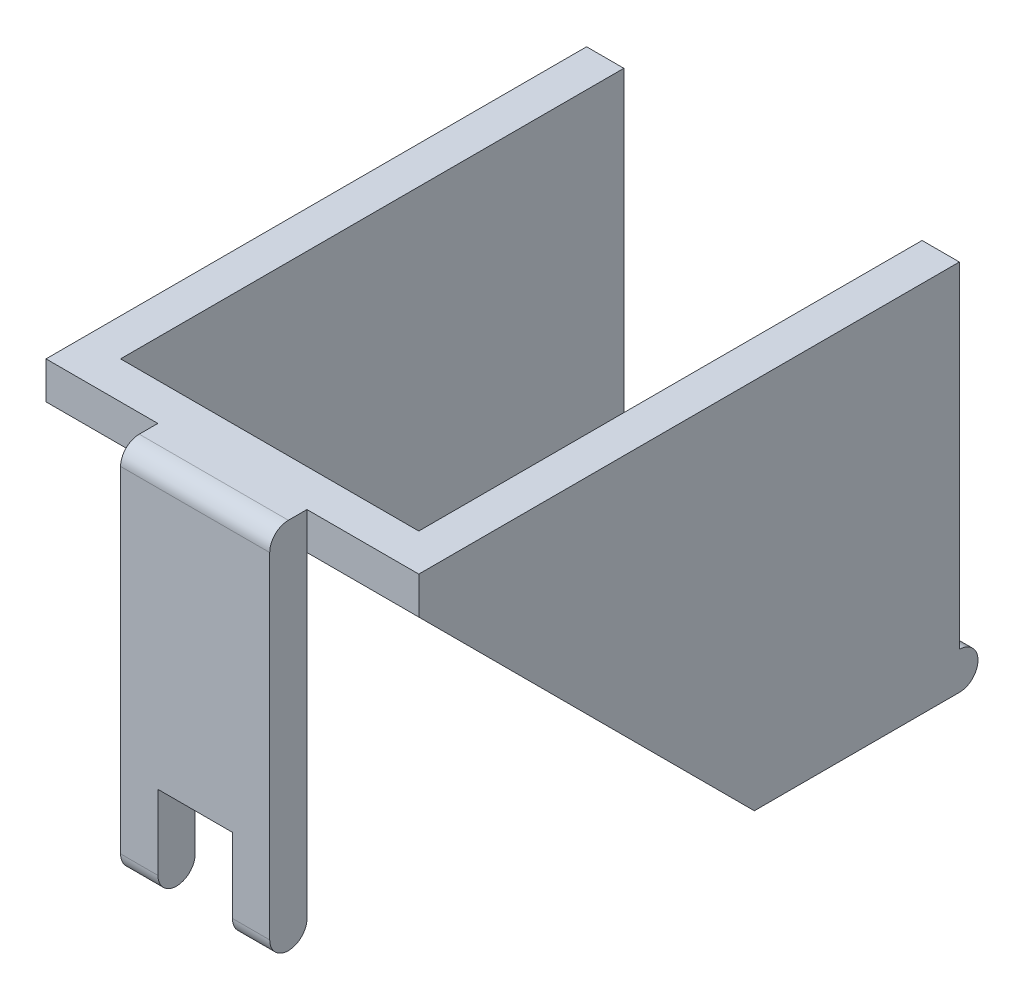
ISO-10303-21;
HEADER;
FILE_DESCRIPTION(('STEP AP214'),'2;1');
FILE_NAME('part.step','',(''),(''),'','','');
FILE_SCHEMA(('AUTOMOTIVE_DESIGN { 1 0 10303 214 1 1 1 1 }'));
ENDSEC;
DATA;
#1=APPLICATION_CONTEXT('core data for automotive mechanical design processes');
#2=APPLICATION_PROTOCOL_DEFINITION('international standard','automotive_design',2000,#1);
#3=PRODUCT_CONTEXT('',#1,'mechanical');
#4=PRODUCT('Part','Part','',(#3));
#5=PRODUCT_RELATED_PRODUCT_CATEGORY('part','',(#4));
#6=PRODUCT_DEFINITION_FORMATION('','',#4);
#7=PRODUCT_DEFINITION_CONTEXT('part definition',#1,'design');
#8=PRODUCT_DEFINITION('design','',#6,#7);
#9=PRODUCT_DEFINITION_SHAPE('','',#8);
#10=(LENGTH_UNIT() NAMED_UNIT(*) SI_UNIT(.MILLI.,.METRE.));
#11=(NAMED_UNIT(*) PLANE_ANGLE_UNIT() SI_UNIT($,.RADIAN.));
#12=(NAMED_UNIT(*) SI_UNIT($,.STERADIAN.) SOLID_ANGLE_UNIT());
#13=UNCERTAINTY_MEASURE_WITH_UNIT(LENGTH_MEASURE(1.E-05),#10,'distance_accuracy_value','');
#14=(GEOMETRIC_REPRESENTATION_CONTEXT(3) GLOBAL_UNCERTAINTY_ASSIGNED_CONTEXT((#13)) GLOBAL_UNIT_ASSIGNED_CONTEXT((#10,
#11,#12)) REPRESENTATION_CONTEXT('',''));
#15=CARTESIAN_POINT('',(0.,0.,0.));
#16=DIRECTION('',(0.,0.,1.));
#17=DIRECTION('',(1.,0.,0.));
#18=AXIS2_PLACEMENT_3D('',#15,#16,#17);
#19=CARTESIAN_POINT('',(0.,-9.,-15.));
#20=DIRECTION('',(1.,0.,0.));
#21=DIRECTION('',(0.,0.,-1.));
#22=AXIS2_PLACEMENT_3D('',#19,#20,#21);
#23=CYLINDRICAL_SURFACE('',#22,1.);
#24=CARTESIAN_POINT('',(6.,-9.,-15.));
#25=DIRECTION('',(-1.,0.,0.));
#26=DIRECTION('',(0.,0.,1.));
#27=AXIS2_PLACEMENT_3D('',#24,#25,#26);
#28=CIRCLE('',#27,1.);
#29=CARTESIAN_POINT('',(6.,-10.,-15.));
#30=VERTEX_POINT('',#29);
#31=CARTESIAN_POINT('',(6.,-8.,-15.));
#32=VERTEX_POINT('',#31);
#33=EDGE_CURVE('E238',#30,#32,#28,.F.);
#34=ORIENTED_EDGE('',*,*,#33,.F.);
#35=DIRECTION('',(-1.,0.,0.));
#36=VECTOR('',#35,1.);
#37=CARTESIAN_POINT('',(20.,-10.,-15.));
#38=LINE('',#37,#36);
#39=CARTESIAN_POINT('',(0.,-10.,-15.));
#40=VERTEX_POINT('',#39);
#41=EDGE_CURVE('E391',#30,#40,#38,.T.);
#42=ORIENTED_EDGE('',*,*,#41,.T.);
#43=CARTESIAN_POINT('',(0.,-9.,-15.));
#44=DIRECTION('',(1.,0.,0.));
#45=DIRECTION('',(0.,0.,-1.));
#46=AXIS2_PLACEMENT_3D('',#43,#44,#45);
#47=CIRCLE('',#46,1.);
#48=CARTESIAN_POINT('',(0.,-8.,-15.));
#49=VERTEX_POINT('',#48);
#50=EDGE_CURVE('E295',#40,#49,#47,.T.);
#51=ORIENTED_EDGE('',*,*,#50,.T.);
#52=DIRECTION('',(1.,0.,0.));
#53=VECTOR('',#52,1.);
#54=CARTESIAN_POINT('',(0.,-8.,-15.));
#55=LINE('',#54,#53);
#56=CARTESIAN_POINT('',(2.,-8.,-15.));
#57=VERTEX_POINT('',#56);
#58=EDGE_CURVE('E298',#57,#49,#55,.F.);
#59=ORIENTED_EDGE('',*,*,#58,.F.);
#60=EDGE_CURVE('E304',#32,#57,#55,.F.);
#61=ORIENTED_EDGE('',*,*,#60,.F.);
#62=EDGE_LOOP('',(#34,#42,#51,#59,#61));
#63=FACE_BOUND('',#62,.T.);
#64=ADVANCED_FACE('F38',(#63),#23,.T.);
#65=CARTESIAN_POINT('',(6.,-9.00000000000001,15.0000000000001));
#66=DIRECTION('',(1.,0.,0.));
#67=DIRECTION('',(0.,0.,-1.));
#68=AXIS2_PLACEMENT_3D('',#65,#66,#67);
#69=CYLINDRICAL_SURFACE('',#68,0.999999999999998);
#70=CARTESIAN_POINT('',(8.,-9.00000000000001,15.0000000000001));
#71=DIRECTION('',(-1.,0.,0.));
#72=DIRECTION('',(0.,-1.,0.));
#73=AXIS2_PLACEMENT_3D('',#70,#71,#72);
#74=CIRCLE('',#73,0.999999999999998);
#75=CARTESIAN_POINT('',(8.,-9.00000000000001,16.));
#76=VERTEX_POINT('',#75);
#77=CARTESIAN_POINT('',(8.,-9.00000000000001,14.0000000000001));
#78=VERTEX_POINT('',#77);
#79=EDGE_CURVE('E257',#76,#78,#74,.F.);
#80=ORIENTED_EDGE('',*,*,#79,.F.);
#81=DIRECTION('',(1.,0.,0.));
#82=VECTOR('',#81,1.);
#83=CARTESIAN_POINT('',(6.,-9.00000000000001,16.0000000000001));
#84=LINE('',#83,#82);
#85=CARTESIAN_POINT('',(6.,-9.00000000000001,16.0000000000001));
#86=VERTEX_POINT('',#85);
#87=EDGE_CURVE('E327',#86,#76,#84,.T.);
#88=ORIENTED_EDGE('',*,*,#87,.F.);
#89=CARTESIAN_POINT('',(6.,-9.00000000000001,15.0000000000001));
#90=DIRECTION('',(1.,0.,0.));
#91=DIRECTION('',(0.,0.,-1.));
#92=AXIS2_PLACEMENT_3D('',#89,#90,#91);
#93=CIRCLE('',#92,0.999999999999998);
#94=CARTESIAN_POINT('',(6.,-9.00000000000001,14.0000000000001));
#95=VERTEX_POINT('',#94);
#96=EDGE_CURVE('E308',#86,#95,#93,.T.);
#97=ORIENTED_EDGE('',*,*,#96,.T.);
#98=DIRECTION('',(1.,0.,0.));
#99=VECTOR('',#98,1.);
#100=CARTESIAN_POINT('',(6.,-9.00000000000001,14.0000000000001));
#101=LINE('',#100,#99);
#102=EDGE_CURVE('E322',#95,#78,#101,.T.);
#103=ORIENTED_EDGE('',*,*,#102,.T.);
#104=EDGE_LOOP('',(#80,#88,#97,#103));
#105=FACE_BOUND('',#104,.T.);
#106=ADVANCED_FACE('F446',(#105),#69,.T.);
#107=CARTESIAN_POINT('',(20.,10.,-15.));
#108=DIRECTION('',(0.,0.,1.));
#109=DIRECTION('',(0.,-1.,0.));
#110=AXIS2_PLACEMENT_3D('',#107,#108,#109);
#111=PLANE('',#110);
#112=DIRECTION('',(-1.,0.,0.));
#113=VECTOR('',#112,1.);
#114=CARTESIAN_POINT('',(20.,10.,-15.));
#115=LINE('',#114,#113);
#116=CARTESIAN_POINT('',(2.,10.,-15.));
#117=VERTEX_POINT('',#116);
#118=CARTESIAN_POINT('',(0.,10.,-15.));
#119=VERTEX_POINT('',#118);
#120=EDGE_CURVE('E387',#117,#119,#115,.T.);
#121=ORIENTED_EDGE('',*,*,#120,.F.);
#122=DIRECTION('',(0.,-1.,0.));
#123=VECTOR('',#122,1.);
#124=CARTESIAN_POINT('',(2.,10.,-15.));
#125=LINE('',#124,#123);
#126=EDGE_CURVE('E285',#117,#57,#125,.T.);
#127=ORIENTED_EDGE('',*,*,#126,.T.);
#128=ORIENTED_EDGE('',*,*,#58,.T.);
#129=DIRECTION('',(0.,1.,0.));
#130=VECTOR('',#129,1.);
#131=CARTESIAN_POINT('',(0.,10.,-15.));
#132=LINE('',#131,#130);
#133=EDGE_CURVE('E380',#49,#119,#132,.T.);
#134=ORIENTED_EDGE('',*,*,#133,.T.);
#135=EDGE_LOOP('',(#121,#127,#128,#134));
#136=FACE_BOUND('',#135,.T.);
#137=ADVANCED_FACE('F466',(#136),#111,.F.);
#138=CARTESIAN_POINT('',(20.,9.,15.));
#139=DIRECTION('',(-1.,0.,0.));
#140=DIRECTION('',(0.,0.,1.));
#141=AXIS2_PLACEMENT_3D('',#138,#139,#140);
#142=CYLINDRICAL_SURFACE('',#141,1.);
#143=DIRECTION('',(1.,0.,0.));
#144=VECTOR('',#143,1.);
#145=CARTESIAN_POINT('',(6.,9.,16.));
#146=LINE('',#145,#144);
#147=CARTESIAN_POINT('',(6.,9.,16.));
#148=VERTEX_POINT('',#147);
#149=CARTESIAN_POINT('',(14.,9.,16.));
#150=VERTEX_POINT('',#149);
#151=EDGE_CURVE('E315',#148,#150,#146,.T.);
#152=ORIENTED_EDGE('',*,*,#151,.T.);
#153=CARTESIAN_POINT('',(14.,9.,15.));
#154=DIRECTION('',(-1.,0.,0.));
#155=DIRECTION('',(0.,0.,1.));
#156=AXIS2_PLACEMENT_3D('',#153,#154,#155);
#157=CIRCLE('',#156,1.);
#158=CARTESIAN_POINT('',(14.,10.,15.));
#159=VERTEX_POINT('',#158);
#160=EDGE_CURVE('E358',#150,#159,#157,.T.);
#161=ORIENTED_EDGE('',*,*,#160,.T.);
#162=DIRECTION('',(-1.,0.,0.));
#163=VECTOR('',#162,1.);
#164=CARTESIAN_POINT('',(20.,10.,15.));
#165=LINE('',#164,#163);
#166=CARTESIAN_POINT('',(6.,10.,15.));
#167=VERTEX_POINT('',#166);
#168=EDGE_CURVE('E375',#159,#167,#165,.T.);
#169=ORIENTED_EDGE('',*,*,#168,.T.);
#170=CARTESIAN_POINT('',(6.,9.,15.));
#171=DIRECTION('',(1.,0.,0.));
#172=DIRECTION('',(0.,0.,-1.));
#173=AXIS2_PLACEMENT_3D('',#170,#171,#172);
#174=CIRCLE('',#173,1.);
#175=EDGE_CURVE('E360',#167,#148,#174,.T.);
#176=ORIENTED_EDGE('',*,*,#175,.T.);
#177=EDGE_LOOP('',(#152,#161,#169,#176));
#178=FACE_BOUND('',#177,.T.);
#179=ADVANCED_FACE('F40',(#178),#142,.T.);
#180=CARTESIAN_POINT('',(20.,8.29289321881345,14.2928932188134));
#181=DIRECTION('',(0.,0.707106781186547,-0.707106781186548));
#182=DIRECTION('',(0.,0.707106781186548,0.707106781186547));
#183=AXIS2_PLACEMENT_3D('',#180,#181,#182);
#184=PLANE('',#183);
#185=DIRECTION('',(0.,0.707106781186548,0.707106781186547));
#186=VECTOR('',#185,1.);
#187=CARTESIAN_POINT('',(2.,8.29289321881345,14.2928932188134));
#188=LINE('',#187,#186);
#189=CARTESIAN_POINT('',(2.,-8.,-2.));
#190=VERTEX_POINT('',#189);
#191=CARTESIAN_POINT('',(2.,6.00257999370378,12.0025799937038));
#192=VERTEX_POINT('',#191);
#193=EDGE_CURVE('E288',#190,#192,#188,.T.);
#194=ORIENTED_EDGE('',*,*,#193,.T.);
#195=DIRECTION('',(1.,0.,0.));
#196=VECTOR('',#195,1.);
#197=CARTESIAN_POINT('',(20.,6.00257999370378,12.0025799937038));
#198=LINE('',#197,#196);
#199=CARTESIAN_POINT('',(18.,6.00257999370378,12.0025799937038));
#200=VERTEX_POINT('',#199);
#201=EDGE_CURVE('E291',#192,#200,#198,.T.);
#202=ORIENTED_EDGE('',*,*,#201,.T.);
#203=DIRECTION('',(0.,-0.707106781186548,-0.707106781186547));
#204=VECTOR('',#203,1.);
#205=CARTESIAN_POINT('',(18.,8.29289321881345,14.2928932188134));
#206=LINE('',#205,#204);
#207=CARTESIAN_POINT('',(18.,-8.,-2.));
#208=VERTEX_POINT('',#207);
#209=EDGE_CURVE('E282',#200,#208,#206,.T.);
#210=ORIENTED_EDGE('',*,*,#209,.T.);
#211=DIRECTION('',(1.,0.,0.));
#212=VECTOR('',#211,1.);
#213=CARTESIAN_POINT('',(20.,-8.,-2.));
#214=LINE('',#213,#212);
#215=EDGE_CURVE('E276',#190,#208,#214,.T.);
#216=ORIENTED_EDGE('',*,*,#215,.F.);
#217=EDGE_LOOP('',(#194,#202,#210,#216));
#218=FACE_BOUND('',#217,.T.);
#219=DIRECTION('',(0.,-0.707106781186548,-0.707106781186547));
#220=VECTOR('',#219,1.);
#221=CARTESIAN_POINT('',(6.,8.29289321881345,14.2928932188134));
#222=LINE('',#221,#220);
#223=CARTESIAN_POINT('',(6.,8.00257999370377,14.0025799937038));
#224=VERTEX_POINT('',#223);
#225=CARTESIAN_POINT('',(6.,8.,14.));
#226=VERTEX_POINT('',#225);
#227=EDGE_CURVE('E335',#224,#226,#222,.T.);
#228=ORIENTED_EDGE('',*,*,#227,.F.);
#229=DIRECTION('',(-1.,0.,0.));
#230=VECTOR('',#229,1.);
#231=CARTESIAN_POINT('',(20.,8.00257999370378,14.0025799937038));
#232=LINE('',#231,#230);
#233=CARTESIAN_POINT('',(0.,8.00257999370378,14.0025799937038));
#234=VERTEX_POINT('',#233);
#235=EDGE_CURVE('E346',#224,#234,#232,.T.);
#236=ORIENTED_EDGE('',*,*,#235,.T.);
#237=DIRECTION('',(0.,-0.707106781186548,-0.707106781186547));
#238=VECTOR('',#237,1.);
#239=CARTESIAN_POINT('',(0.,8.29289321881345,14.2928932188134));
#240=LINE('',#239,#238);
#241=CARTESIAN_POINT('',(0.,-10.,-4.00000000000001));
#242=VERTEX_POINT('',#241);
#243=EDGE_CURVE('E363',#234,#242,#240,.T.);
#244=ORIENTED_EDGE('',*,*,#243,.T.);
#245=DIRECTION('',(-1.,0.,0.));
#246=VECTOR('',#245,1.);
#247=CARTESIAN_POINT('',(20.,-10.,-4.00000000000001));
#248=LINE('',#247,#246);
#249=CARTESIAN_POINT('',(20.,-10.,-4.00000000000001));
#250=VERTEX_POINT('',#249);
#251=EDGE_CURVE('E395',#250,#242,#248,.T.);
#252=ORIENTED_EDGE('',*,*,#251,.F.);
#253=DIRECTION('',(0.,-0.707106781186548,-0.707106781186547));
#254=VECTOR('',#253,1.);
#255=CARTESIAN_POINT('',(20.,8.29289321881345,14.2928932188134));
#256=LINE('',#255,#254);
#257=CARTESIAN_POINT('',(20.,8.00257999370378,14.0025799937038));
#258=VERTEX_POINT('',#257);
#259=EDGE_CURVE('E364',#258,#250,#256,.T.);
#260=ORIENTED_EDGE('',*,*,#259,.F.);
#261=DIRECTION('',(-1.,0.,0.));
#262=VECTOR('',#261,1.);
#263=CARTESIAN_POINT('',(20.,8.00257999370378,14.0025799937038));
#264=LINE('',#263,#262);
#265=CARTESIAN_POINT('',(14.,8.00257999370377,14.0025799937038));
#266=VERTEX_POINT('',#265);
#267=EDGE_CURVE('E355',#258,#266,#264,.T.);
#268=ORIENTED_EDGE('',*,*,#267,.T.);
#269=DIRECTION('',(0.,-0.707106781186548,-0.707106781186547));
#270=VECTOR('',#269,1.);
#271=CARTESIAN_POINT('',(14.,8.29289321881345,14.2928932188134));
#272=LINE('',#271,#270);
#273=CARTESIAN_POINT('',(14.,7.99999999999999,14.));
#274=VERTEX_POINT('',#273);
#275=EDGE_CURVE('E325',#266,#274,#272,.T.);
#276=ORIENTED_EDGE('',*,*,#275,.T.);
#277=DIRECTION('',(-1.,0.,0.));
#278=VECTOR('',#277,1.);
#279=CARTESIAN_POINT('',(20.,8.,14.));
#280=LINE('',#279,#278);
#281=EDGE_CURVE('E403',#274,#226,#280,.T.);
#282=ORIENTED_EDGE('',*,*,#281,.T.);
#283=EDGE_LOOP('',(#228,#236,#244,#252,#260,#268,#276,#282));
#284=FACE_BOUND('',#283,.T.);
#285=ADVANCED_FACE('F513',(#218,#284),#184,.F.);
#286=CARTESIAN_POINT('',(20.,-10.,-4.00000000000001));
#287=DIRECTION('',(0.,1.,0.));
#288=DIRECTION('',(0.,0.,1.));
#289=AXIS2_PLACEMENT_3D('',#286,#287,#288);
#290=PLANE('',#289);
#291=ORIENTED_EDGE('',*,*,#41,.F.);
#292=DIRECTION('',(0.,0.,1.));
#293=VECTOR('',#292,1.);
#294=CARTESIAN_POINT('',(6.,-10.,-4.00000000000001));
#295=LINE('',#294,#293);
#296=CARTESIAN_POINT('',(6.,-10.,-12.));
#297=VERTEX_POINT('',#296);
#298=EDGE_CURVE('E240',#30,#297,#295,.T.);
#299=ORIENTED_EDGE('',*,*,#298,.T.);
#300=DIRECTION('',(1.,0.,0.));
#301=VECTOR('',#300,1.);
#302=CARTESIAN_POINT('',(20.,-10.,-12.));
#303=LINE('',#302,#301);
#304=CARTESIAN_POINT('',(14.,-10.,-12.));
#305=VERTEX_POINT('',#304);
#306=EDGE_CURVE('E219',#297,#305,#303,.T.);
#307=ORIENTED_EDGE('',*,*,#306,.T.);
#308=DIRECTION('',(0.,0.,-1.));
#309=VECTOR('',#308,1.);
#310=CARTESIAN_POINT('',(14.,-10.,-4.00000000000001));
#311=LINE('',#310,#309);
#312=CARTESIAN_POINT('',(14.,-10.,-15.));
#313=VERTEX_POINT('',#312);
#314=EDGE_CURVE('E217',#305,#313,#311,.T.);
#315=ORIENTED_EDGE('',*,*,#314,.T.);
#316=CARTESIAN_POINT('',(20.,-10.,-15.));
#317=VERTEX_POINT('',#316);
#318=EDGE_CURVE('E392',#317,#313,#38,.T.);
#319=ORIENTED_EDGE('',*,*,#318,.F.);
#320=DIRECTION('',(0.,0.,-1.));
#321=VECTOR('',#320,1.);
#322=CARTESIAN_POINT('',(20.,-10.,-4.00000000000001));
#323=LINE('',#322,#321);
#324=EDGE_CURVE('E366',#250,#317,#323,.T.);
#325=ORIENTED_EDGE('',*,*,#324,.F.);
#326=ORIENTED_EDGE('',*,*,#251,.T.);
#327=DIRECTION('',(0.,0.,-1.));
#328=VECTOR('',#327,1.);
#329=CARTESIAN_POINT('',(0.,-10.,-4.00000000000001));
#330=LINE('',#329,#328);
#331=EDGE_CURVE('E377',#242,#40,#330,.T.);
#332=ORIENTED_EDGE('',*,*,#331,.T.);
#333=EDGE_LOOP('',(#291,#299,#307,#315,#319,#325,#326,#332));
#334=FACE_BOUND('',#333,.T.);
#335=ADVANCED_FACE('F486',(#334),#290,.F.);
#336=CARTESIAN_POINT('',(20.,-8.,-15.));
#337=VERTEX_POINT('',#336);
#338=CARTESIAN_POINT('',(18.,-8.,-15.));
#339=VERTEX_POINT('',#338);
#340=EDGE_CURVE('E300',#337,#339,#55,.F.);
#341=ORIENTED_EDGE('',*,*,#340,.T.);
#342=DIRECTION('',(0.,1.,0.));
#343=VECTOR('',#342,1.);
#344=CARTESIAN_POINT('',(18.,10.,-15.));
#345=LINE('',#344,#343);
#346=CARTESIAN_POINT('',(18.,10.,-15.));
#347=VERTEX_POINT('',#346);
#348=EDGE_CURVE('E279',#339,#347,#345,.T.);
#349=ORIENTED_EDGE('',*,*,#348,.T.);
#350=CARTESIAN_POINT('',(20.,10.,-15.));
#351=VERTEX_POINT('',#350);
#352=EDGE_CURVE('E388',#351,#347,#115,.T.);
#353=ORIENTED_EDGE('',*,*,#352,.F.);
#354=DIRECTION('',(0.,1.,0.));
#355=VECTOR('',#354,1.);
#356=CARTESIAN_POINT('',(20.,10.,-15.));
#357=LINE('',#356,#355);
#358=EDGE_CURVE('E370',#337,#351,#357,.T.);
#359=ORIENTED_EDGE('',*,*,#358,.F.);
#360=EDGE_LOOP('',(#341,#349,#353,#359));
#361=FACE_BOUND('',#360,.T.);
#362=ADVANCED_FACE('F517',(#361),#111,.F.);
#363=CARTESIAN_POINT('',(20.,10.,15.));
#364=DIRECTION('',(0.,-1.,0.));
#365=DIRECTION('',(0.,0.,-1.));
#366=AXIS2_PLACEMENT_3D('',#363,#364,#365);
#367=PLANE('',#366);
#368=DIRECTION('',(1.,0.,0.));
#369=VECTOR('',#368,1.);
#370=CARTESIAN_POINT('',(2.,10.,12.0025799937038));
#371=LINE('',#370,#369);
#372=CARTESIAN_POINT('',(2.,10.,12.0025799937038));
#373=VERTEX_POINT('',#372);
#374=CARTESIAN_POINT('',(18.,10.,12.0025799937038));
#375=VERTEX_POINT('',#374);
#376=EDGE_CURVE('E270',#373,#375,#371,.T.);
#377=ORIENTED_EDGE('',*,*,#376,.F.);
#378=DIRECTION('',(0.,0.,1.));
#379=VECTOR('',#378,1.);
#380=CARTESIAN_POINT('',(2.,10.,-16.6750033301754));
#381=LINE('',#380,#379);
#382=EDGE_CURVE('E261',#117,#373,#381,.T.);
#383=ORIENTED_EDGE('',*,*,#382,.F.);
#384=ORIENTED_EDGE('',*,*,#120,.T.);
#385=DIRECTION('',(0.,0.,1.));
#386=VECTOR('',#385,1.);
#387=CARTESIAN_POINT('',(0.,10.,15.));
#388=LINE('',#387,#386);
#389=CARTESIAN_POINT('',(0.,10.,14.0025799937038));
#390=VERTEX_POINT('',#389);
#391=EDGE_CURVE('E367',#119,#390,#388,.T.);
#392=ORIENTED_EDGE('',*,*,#391,.T.);
#393=DIRECTION('',(-1.,0.,0.));
#394=VECTOR('',#393,1.);
#395=CARTESIAN_POINT('',(0.,10.,14.0025799937038));
#396=LINE('',#395,#394);
#397=CARTESIAN_POINT('',(6.,10.,14.0025799937038));
#398=VERTEX_POINT('',#397);
#399=EDGE_CURVE('E341',#398,#390,#396,.T.);
#400=ORIENTED_EDGE('',*,*,#399,.F.);
#401=DIRECTION('',(0.,0.,-1.));
#402=VECTOR('',#401,1.);
#403=CARTESIAN_POINT('',(6.,10.,14.0025799937038));
#404=LINE('',#403,#402);
#405=EDGE_CURVE('E338',#167,#398,#404,.T.);
#406=ORIENTED_EDGE('',*,*,#405,.F.);
#407=ORIENTED_EDGE('',*,*,#168,.F.);
#408=DIRECTION('',(0.,0.,1.));
#409=VECTOR('',#408,1.);
#410=CARTESIAN_POINT('',(14.,10.,14.0025799937038));
#411=LINE('',#410,#409);
#412=CARTESIAN_POINT('',(14.,10.,14.0025799937038));
#413=VERTEX_POINT('',#412);
#414=EDGE_CURVE('E349',#413,#159,#411,.T.);
#415=ORIENTED_EDGE('',*,*,#414,.F.);
#416=DIRECTION('',(-1.,0.,0.));
#417=VECTOR('',#416,1.);
#418=CARTESIAN_POINT('',(14.,10.,14.0025799937038));
#419=LINE('',#418,#417);
#420=CARTESIAN_POINT('',(20.,10.,14.0025799937038));
#421=VERTEX_POINT('',#420);
#422=EDGE_CURVE('E337',#421,#413,#419,.T.);
#423=ORIENTED_EDGE('',*,*,#422,.F.);
#424=DIRECTION('',(0.,0.,1.));
#425=VECTOR('',#424,1.);
#426=CARTESIAN_POINT('',(20.,10.,15.));
#427=LINE('',#426,#425);
#428=EDGE_CURVE('E372',#351,#421,#427,.T.);
#429=ORIENTED_EDGE('',*,*,#428,.F.);
#430=ORIENTED_EDGE('',*,*,#352,.T.);
#431=DIRECTION('',(0.,0.,-1.));
#432=VECTOR('',#431,1.);
#433=CARTESIAN_POINT('',(18.,10.,-16.6750033301754));
#434=LINE('',#433,#432);
#435=EDGE_CURVE('E265',#375,#347,#434,.T.);
#436=ORIENTED_EDGE('',*,*,#435,.F.);
#437=EDGE_LOOP('',(#377,#383,#384,#392,#400,#406,#407,#415,#423,#429,#430,#436));
#438=FACE_BOUND('',#437,.T.);
#439=ADVANCED_FACE('F437',(#438),#367,.F.);
#440=CARTESIAN_POINT('',(20.,9.,15.));
#441=DIRECTION('',(1.,0.,0.));
#442=DIRECTION('',(0.,0.,-1.));
#443=AXIS2_PLACEMENT_3D('',#440,#441,#442);
#444=PLANE('',#443);
#445=ORIENTED_EDGE('',*,*,#324,.T.);
#446=CARTESIAN_POINT('',(20.,-9.,-15.));
#447=DIRECTION('',(1.,0.,0.));
#448=DIRECTION('',(0.,0.,-1.));
#449=AXIS2_PLACEMENT_3D('',#446,#447,#448);
#450=CIRCLE('',#449,1.);
#451=EDGE_CURVE('E294',#317,#337,#450,.T.);
#452=ORIENTED_EDGE('',*,*,#451,.T.);
#453=ORIENTED_EDGE('',*,*,#358,.T.);
#454=ORIENTED_EDGE('',*,*,#428,.T.);
#455=DIRECTION('',(0.,1.,0.));
#456=VECTOR('',#455,1.);
#457=CARTESIAN_POINT('',(20.,9.,14.0025799937038));
#458=LINE('',#457,#456);
#459=EDGE_CURVE('E401',#258,#421,#458,.T.);
#460=ORIENTED_EDGE('',*,*,#459,.F.);
#461=ORIENTED_EDGE('',*,*,#259,.T.);
#462=EDGE_LOOP('',(#445,#452,#453,#454,#460,#461));
#463=FACE_BOUND('',#462,.T.);
#464=ADVANCED_FACE('F522',(#463),#444,.T.);
#465=CARTESIAN_POINT('',(0.,9.,15.));
#466=DIRECTION('',(1.,0.,0.));
#467=DIRECTION('',(0.,0.,-1.));
#468=AXIS2_PLACEMENT_3D('',#465,#466,#467);
#469=PLANE('',#468);
#470=ORIENTED_EDGE('',*,*,#133,.F.);
#471=ORIENTED_EDGE('',*,*,#50,.F.);
#472=ORIENTED_EDGE('',*,*,#331,.F.);
#473=ORIENTED_EDGE('',*,*,#243,.F.);
#474=DIRECTION('',(0.,1.,0.));
#475=VECTOR('',#474,1.);
#476=CARTESIAN_POINT('',(0.,9.,14.0025799937038));
#477=LINE('',#476,#475);
#478=EDGE_CURVE('E398',#234,#390,#477,.T.);
#479=ORIENTED_EDGE('',*,*,#478,.T.);
#480=ORIENTED_EDGE('',*,*,#391,.F.);
#481=EDGE_LOOP('',(#470,#471,#472,#473,#479,#480));
#482=FACE_BOUND('',#481,.T.);
#483=ADVANCED_FACE('F500',(#482),#469,.F.);
#484=CARTESIAN_POINT('',(6.,-10.,14.0025799937038));
#485=DIRECTION('',(1.,0.,0.));
#486=DIRECTION('',(0.,0.,-1.));
#487=AXIS2_PLACEMENT_3D('',#484,#485,#486);
#488=PLANE('',#487);
#489=ORIENTED_EDGE('',*,*,#405,.T.);
#490=DIRECTION('',(0.,1.,0.));
#491=VECTOR('',#490,1.);
#492=CARTESIAN_POINT('',(6.,-10.,14.0025799937038));
#493=LINE('',#492,#491);
#494=EDGE_CURVE('E344',#224,#398,#493,.T.);
#495=ORIENTED_EDGE('',*,*,#494,.F.);
#496=ORIENTED_EDGE('',*,*,#227,.T.);
#497=DIRECTION('',(0.,1.,0.));
#498=VECTOR('',#497,1.);
#499=CARTESIAN_POINT('',(6.,9.,14.));
#500=LINE('',#499,#498);
#501=EDGE_CURVE('E312',#95,#226,#500,.T.);
#502=ORIENTED_EDGE('',*,*,#501,.F.);
#503=ORIENTED_EDGE('',*,*,#96,.F.);
#504=DIRECTION('',(0.,-1.,0.));
#505=VECTOR('',#504,1.);
#506=CARTESIAN_POINT('',(6.,9.,16.));
#507=LINE('',#506,#505);
#508=EDGE_CURVE('E305',#148,#86,#507,.T.);
#509=ORIENTED_EDGE('',*,*,#508,.F.);
#510=ORIENTED_EDGE('',*,*,#175,.F.);
#511=EDGE_LOOP('',(#489,#495,#496,#502,#503,#509,#510));
#512=FACE_BOUND('',#511,.T.);
#513=ADVANCED_FACE('F441',(#512),#488,.F.);
#514=CARTESIAN_POINT('',(0.,-10.,14.0025799937038));
#515=DIRECTION('',(0.,0.,-1.));
#516=DIRECTION('',(-1.,0.,0.));
#517=AXIS2_PLACEMENT_3D('',#514,#515,#516);
#518=PLANE('',#517);
#519=ORIENTED_EDGE('',*,*,#494,.T.);
#520=ORIENTED_EDGE('',*,*,#399,.T.);
#521=ORIENTED_EDGE('',*,*,#478,.F.);
#522=ORIENTED_EDGE('',*,*,#235,.F.);
#523=EDGE_LOOP('',(#519,#520,#521,#522));
#524=FACE_BOUND('',#523,.T.);
#525=ADVANCED_FACE('F527',(#524),#518,.F.);
#526=CARTESIAN_POINT('',(14.,-10.,14.0025799937038));
#527=DIRECTION('',(-1.,0.,0.));
#528=DIRECTION('',(0.,0.,1.));
#529=AXIS2_PLACEMENT_3D('',#526,#527,#528);
#530=PLANE('',#529);
#531=ORIENTED_EDGE('',*,*,#160,.F.);
#532=DIRECTION('',(0.,-1.,0.));
#533=VECTOR('',#532,1.);
#534=CARTESIAN_POINT('',(14.,9.,16.));
#535=LINE('',#534,#533);
#536=CARTESIAN_POINT('',(14.,-9.00000000000001,16.0000000000001));
#537=VERTEX_POINT('',#536);
#538=EDGE_CURVE('E303',#150,#537,#535,.T.);
#539=ORIENTED_EDGE('',*,*,#538,.T.);
#540=CARTESIAN_POINT('',(14.,-9.00000000000001,15.0000000000001));
#541=DIRECTION('',(1.,0.,0.));
#542=DIRECTION('',(0.,0.,-1.));
#543=AXIS2_PLACEMENT_3D('',#540,#541,#542);
#544=CIRCLE('',#543,0.999999999999998);
#545=CARTESIAN_POINT('',(14.,-9.00000000000001,14.0000000000001));
#546=VERTEX_POINT('',#545);
#547=EDGE_CURVE('E318',#537,#546,#544,.T.);
#548=ORIENTED_EDGE('',*,*,#547,.T.);
#549=DIRECTION('',(0.,1.,0.));
#550=VECTOR('',#549,1.);
#551=CARTESIAN_POINT('',(14.,9.,14.));
#552=LINE('',#551,#550);
#553=EDGE_CURVE('E309',#546,#274,#552,.T.);
#554=ORIENTED_EDGE('',*,*,#553,.T.);
#555=ORIENTED_EDGE('',*,*,#275,.F.);
#556=DIRECTION('',(0.,1.,0.));
#557=VECTOR('',#556,1.);
#558=CARTESIAN_POINT('',(14.,-10.,14.0025799937038));
#559=LINE('',#558,#557);
#560=EDGE_CURVE('E342',#266,#413,#559,.T.);
#561=ORIENTED_EDGE('',*,*,#560,.T.);
#562=ORIENTED_EDGE('',*,*,#414,.T.);
#563=EDGE_LOOP('',(#531,#539,#548,#554,#555,#561,#562));
#564=FACE_BOUND('',#563,.T.);
#565=ADVANCED_FACE('F429',(#564),#530,.F.);
#566=CARTESIAN_POINT('',(14.,-10.,14.0025799937038));
#567=DIRECTION('',(0.,0.,-1.));
#568=DIRECTION('',(-1.,0.,0.));
#569=AXIS2_PLACEMENT_3D('',#566,#567,#568);
#570=PLANE('',#569);
#571=ORIENTED_EDGE('',*,*,#459,.T.);
#572=ORIENTED_EDGE('',*,*,#422,.T.);
#573=ORIENTED_EDGE('',*,*,#560,.F.);
#574=ORIENTED_EDGE('',*,*,#267,.F.);
#575=EDGE_LOOP('',(#571,#572,#573,#574));
#576=FACE_BOUND('',#575,.T.);
#577=ADVANCED_FACE('F534',(#576),#570,.F.);
#578=CARTESIAN_POINT('',(6.,9.,14.));
#579=DIRECTION('',(0.,0.,-1.));
#580=DIRECTION('',(0.,1.,0.));
#581=AXIS2_PLACEMENT_3D('',#578,#579,#580);
#582=PLANE('',#581);
#583=DIRECTION('',(0.,1.,0.));
#584=VECTOR('',#583,1.);
#585=CARTESIAN_POINT('',(8.,9.,14.));
#586=LINE('',#585,#584);
#587=CARTESIAN_POINT('',(8.,-5.00000000000001,14.));
#588=VERTEX_POINT('',#587);
#589=EDGE_CURVE('E259',#78,#588,#586,.T.);
#590=ORIENTED_EDGE('',*,*,#589,.F.);
#591=ORIENTED_EDGE('',*,*,#102,.F.);
#592=ORIENTED_EDGE('',*,*,#501,.T.);
#593=ORIENTED_EDGE('',*,*,#281,.F.);
#594=ORIENTED_EDGE('',*,*,#553,.F.);
#595=CARTESIAN_POINT('',(12.,-9.00000000000001,14.0000000000001));
#596=VERTEX_POINT('',#595);
#597=EDGE_CURVE('E326',#596,#546,#101,.T.);
#598=ORIENTED_EDGE('',*,*,#597,.F.);
#599=DIRECTION('',(0.,-1.,0.));
#600=VECTOR('',#599,1.);
#601=CARTESIAN_POINT('',(12.,9.,14.));
#602=LINE('',#601,#600);
#603=CARTESIAN_POINT('',(12.,-5.00000000000001,14.0000000000001));
#604=VERTEX_POINT('',#603);
#605=EDGE_CURVE('E253',#604,#596,#602,.T.);
#606=ORIENTED_EDGE('',*,*,#605,.F.);
#607=DIRECTION('',(1.,0.,0.));
#608=VECTOR('',#607,1.);
#609=CARTESIAN_POINT('',(6.,-5.00000000000001,14.));
#610=LINE('',#609,#608);
#611=EDGE_CURVE('E255',#588,#604,#610,.T.);
#612=ORIENTED_EDGE('',*,*,#611,.F.);
#613=EDGE_LOOP('',(#590,#591,#592,#593,#594,#598,#606,#612));
#614=FACE_BOUND('',#613,.T.);
#615=ADVANCED_FACE('F419',(#614),#582,.T.);
#616=CARTESIAN_POINT('',(12.,-9.00000000000001,15.0000000000001));
#617=DIRECTION('',(1.,0.,0.));
#618=DIRECTION('',(0.,1.,0.));
#619=AXIS2_PLACEMENT_3D('',#616,#617,#618);
#620=CIRCLE('',#619,0.999999999999998);
#621=CARTESIAN_POINT('',(12.,-9.00000000000001,16.0000000000001));
#622=VERTEX_POINT('',#621);
#623=EDGE_CURVE('E60',#596,#622,#620,.F.);
#624=ORIENTED_EDGE('',*,*,#623,.F.);
#625=ORIENTED_EDGE('',*,*,#597,.T.);
#626=ORIENTED_EDGE('',*,*,#547,.F.);
#627=EDGE_CURVE('E330',#622,#537,#84,.T.);
#628=ORIENTED_EDGE('',*,*,#627,.F.);
#629=EDGE_LOOP('',(#624,#625,#626,#628));
#630=FACE_BOUND('',#629,.T.);
#631=ADVANCED_FACE('F423',(#630),#69,.T.);
#632=CARTESIAN_POINT('',(6.,9.,16.));
#633=DIRECTION('',(0.,0.,1.));
#634=DIRECTION('',(0.,-1.,0.));
#635=AXIS2_PLACEMENT_3D('',#632,#633,#634);
#636=PLANE('',#635);
#637=DIRECTION('',(0.,-1.,0.));
#638=VECTOR('',#637,1.);
#639=CARTESIAN_POINT('',(8.,-5.00000000000001,16.));
#640=LINE('',#639,#638);
#641=CARTESIAN_POINT('',(8.,-5.00000000000001,16.));
#642=VERTEX_POINT('',#641);
#643=EDGE_CURVE('E243',#642,#76,#640,.T.);
#644=ORIENTED_EDGE('',*,*,#643,.F.);
#645=DIRECTION('',(-1.,0.,0.));
#646=VECTOR('',#645,1.);
#647=CARTESIAN_POINT('',(8.,-5.00000000000001,16.));
#648=LINE('',#647,#646);
#649=CARTESIAN_POINT('',(12.,-5.00000000000001,16.));
#650=VERTEX_POINT('',#649);
#651=EDGE_CURVE('E245',#650,#642,#648,.T.);
#652=ORIENTED_EDGE('',*,*,#651,.F.);
#653=DIRECTION('',(0.,1.,0.));
#654=VECTOR('',#653,1.);
#655=CARTESIAN_POINT('',(12.,9.00000000000001,16.));
#656=LINE('',#655,#654);
#657=EDGE_CURVE('E46',#622,#650,#656,.T.);
#658=ORIENTED_EDGE('',*,*,#657,.F.);
#659=ORIENTED_EDGE('',*,*,#627,.T.);
#660=ORIENTED_EDGE('',*,*,#538,.F.);
#661=ORIENTED_EDGE('',*,*,#151,.F.);
#662=ORIENTED_EDGE('',*,*,#508,.T.);
#663=ORIENTED_EDGE('',*,*,#87,.T.);
#664=EDGE_LOOP('',(#644,#652,#658,#659,#660,#661,#662,#663));
#665=FACE_BOUND('',#664,.T.);
#666=ADVANCED_FACE('F412',(#665),#636,.T.);
#667=ORIENTED_EDGE('',*,*,#318,.T.);
#668=CARTESIAN_POINT('',(14.,-9.,-15.));
#669=DIRECTION('',(1.,0.,0.));
#670=DIRECTION('',(0.,0.,-1.));
#671=AXIS2_PLACEMENT_3D('',#668,#669,#670);
#672=CIRCLE('',#671,1.);
#673=CARTESIAN_POINT('',(14.,-8.,-15.));
#674=VERTEX_POINT('',#673);
#675=EDGE_CURVE('E235',#674,#313,#672,.F.);
#676=ORIENTED_EDGE('',*,*,#675,.F.);
#677=EDGE_CURVE('E230',#339,#674,#55,.F.);
#678=ORIENTED_EDGE('',*,*,#677,.F.);
#679=ORIENTED_EDGE('',*,*,#340,.F.);
#680=ORIENTED_EDGE('',*,*,#451,.F.);
#681=EDGE_LOOP('',(#667,#676,#678,#679,#680));
#682=FACE_BOUND('',#681,.T.);
#683=ADVANCED_FACE('F462',(#682),#23,.T.);
#684=CARTESIAN_POINT('',(2.,-8.,12.0025799937038));
#685=DIRECTION('',(0.,0.,1.));
#686=DIRECTION('',(1.,0.,0.));
#687=AXIS2_PLACEMENT_3D('',#684,#685,#686);
#688=PLANE('',#687);
#689=DIRECTION('',(0.,1.,0.));
#690=VECTOR('',#689,1.);
#691=CARTESIAN_POINT('',(2.,-8.,12.0025799937038));
#692=LINE('',#691,#690);
#693=EDGE_CURVE('E267',#192,#373,#692,.T.);
#694=ORIENTED_EDGE('',*,*,#693,.T.);
#695=ORIENTED_EDGE('',*,*,#376,.T.);
#696=DIRECTION('',(0.,1.,0.));
#697=VECTOR('',#696,1.);
#698=CARTESIAN_POINT('',(18.,-8.,12.0025799937038));
#699=LINE('',#698,#697);
#700=EDGE_CURVE('E274',#200,#375,#699,.T.);
#701=ORIENTED_EDGE('',*,*,#700,.F.);
#702=ORIENTED_EDGE('',*,*,#201,.F.);
#703=EDGE_LOOP('',(#694,#695,#701,#702));
#704=FACE_BOUND('',#703,.T.);
#705=ADVANCED_FACE('F471',(#704),#688,.F.);
#706=CARTESIAN_POINT('',(2.,-8.,-16.6750033301754));
#707=DIRECTION('',(-1.,0.,0.));
#708=DIRECTION('',(0.,0.,1.));
#709=AXIS2_PLACEMENT_3D('',#706,#707,#708);
#710=PLANE('',#709);
#711=DIRECTION('',(0.,0.,1.));
#712=VECTOR('',#711,1.);
#713=CARTESIAN_POINT('',(2.,-8.,-16.6750033301754));
#714=LINE('',#713,#712);
#715=EDGE_CURVE('E262',#57,#190,#714,.T.);
#716=ORIENTED_EDGE('',*,*,#715,.F.);
#717=ORIENTED_EDGE('',*,*,#126,.F.);
#718=ORIENTED_EDGE('',*,*,#382,.T.);
#719=ORIENTED_EDGE('',*,*,#693,.F.);
#720=ORIENTED_EDGE('',*,*,#193,.F.);
#721=EDGE_LOOP('',(#716,#717,#718,#719,#720));
#722=FACE_BOUND('',#721,.T.);
#723=ADVANCED_FACE('F477',(#722),#710,.F.);
#724=CARTESIAN_POINT('',(18.,-8.,-16.6750033301754));
#725=DIRECTION('',(1.,0.,0.));
#726=DIRECTION('',(0.,0.,-1.));
#727=AXIS2_PLACEMENT_3D('',#724,#725,#726);
#728=PLANE('',#727);
#729=ORIENTED_EDGE('',*,*,#700,.T.);
#730=ORIENTED_EDGE('',*,*,#435,.T.);
#731=ORIENTED_EDGE('',*,*,#348,.F.);
#732=DIRECTION('',(0.,0.,-1.));
#733=VECTOR('',#732,1.);
#734=CARTESIAN_POINT('',(18.,-8.,-16.6750033301754));
#735=LINE('',#734,#733);
#736=EDGE_CURVE('E264',#208,#339,#735,.T.);
#737=ORIENTED_EDGE('',*,*,#736,.F.);
#738=ORIENTED_EDGE('',*,*,#209,.F.);
#739=EDGE_LOOP('',(#729,#730,#731,#737,#738));
#740=FACE_BOUND('',#739,.T.);
#741=ADVANCED_FACE('F456',(#740),#728,.F.);
#742=CARTESIAN_POINT('',(0.,-8.,0.));
#743=DIRECTION('',(0.,1.,0.));
#744=DIRECTION('',(0.,0.,1.));
#745=AXIS2_PLACEMENT_3D('',#742,#743,#744);
#746=PLANE('',#745);
#747=DIRECTION('',(0.,0.,1.));
#748=VECTOR('',#747,1.);
#749=CARTESIAN_POINT('',(6.,-8.,0.));
#750=LINE('',#749,#748);
#751=CARTESIAN_POINT('',(6.,-8.,-12.));
#752=VERTEX_POINT('',#751);
#753=EDGE_CURVE('E11',#32,#752,#750,.T.);
#754=ORIENTED_EDGE('',*,*,#753,.F.);
#755=ORIENTED_EDGE('',*,*,#60,.T.);
#756=ORIENTED_EDGE('',*,*,#715,.T.);
#757=ORIENTED_EDGE('',*,*,#215,.T.);
#758=ORIENTED_EDGE('',*,*,#736,.T.);
#759=ORIENTED_EDGE('',*,*,#677,.T.);
#760=DIRECTION('',(0.,0.,-1.));
#761=VECTOR('',#760,1.);
#762=CARTESIAN_POINT('',(14.,-8.,-16.));
#763=LINE('',#762,#761);
#764=CARTESIAN_POINT('',(14.,-8.,-12.));
#765=VERTEX_POINT('',#764);
#766=EDGE_CURVE('E214',#765,#674,#763,.T.);
#767=ORIENTED_EDGE('',*,*,#766,.F.);
#768=DIRECTION('',(1.,0.,0.));
#769=VECTOR('',#768,1.);
#770=CARTESIAN_POINT('',(6.,-8.,-12.));
#771=LINE('',#770,#769);
#772=EDGE_CURVE('E222',#752,#765,#771,.T.);
#773=ORIENTED_EDGE('',*,*,#772,.F.);
#774=EDGE_LOOP('',(#754,#755,#756,#757,#758,#759,#767,#773));
#775=FACE_BOUND('',#774,.T.);
#776=ADVANCED_FACE('F228',(#775),#746,.T.);
#777=CARTESIAN_POINT('',(8.,-5.00000000000001,6.00000000000002));
#778=DIRECTION('',(-1.,0.,0.));
#779=DIRECTION('',(0.,-1.,0.));
#780=AXIS2_PLACEMENT_3D('',#777,#778,#779);
#781=PLANE('',#780);
#782=ORIENTED_EDGE('',*,*,#589,.T.);
#783=DIRECTION('',(0.,0.,1.));
#784=VECTOR('',#783,1.);
#785=CARTESIAN_POINT('',(8.,-5.00000000000001,6.00000000000002));
#786=LINE('',#785,#784);
#787=EDGE_CURVE('E249',#588,#642,#786,.T.);
#788=ORIENTED_EDGE('',*,*,#787,.T.);
#789=ORIENTED_EDGE('',*,*,#643,.T.);
#790=ORIENTED_EDGE('',*,*,#79,.T.);
#791=EDGE_LOOP('',(#782,#788,#789,#790));
#792=FACE_BOUND('',#791,.T.);
#793=ADVANCED_FACE('F448',(#792),#781,.F.);
#794=CARTESIAN_POINT('',(8.,-5.00000000000001,6.00000000000002));
#795=DIRECTION('',(0.,1.,0.));
#796=DIRECTION('',(0.,0.,1.));
#797=AXIS2_PLACEMENT_3D('',#794,#795,#796);
#798=PLANE('',#797);
#799=ORIENTED_EDGE('',*,*,#611,.T.);
#800=DIRECTION('',(0.,0.,1.));
#801=VECTOR('',#800,1.);
#802=CARTESIAN_POINT('',(12.,-5.00000000000001,6.00000000000002));
#803=LINE('',#802,#801);
#804=EDGE_CURVE('E248',#604,#650,#803,.T.);
#805=ORIENTED_EDGE('',*,*,#804,.T.);
#806=ORIENTED_EDGE('',*,*,#651,.T.);
#807=ORIENTED_EDGE('',*,*,#787,.F.);
#808=EDGE_LOOP('',(#799,#805,#806,#807));
#809=FACE_BOUND('',#808,.T.);
#810=ADVANCED_FACE('F415',(#809),#798,.F.);
#811=CARTESIAN_POINT('',(12.,-5.00000000000001,6.00000000000002));
#812=DIRECTION('',(1.,0.,0.));
#813=DIRECTION('',(0.,1.,0.));
#814=AXIS2_PLACEMENT_3D('',#811,#812,#813);
#815=PLANE('',#814);
#816=ORIENTED_EDGE('',*,*,#605,.T.);
#817=ORIENTED_EDGE('',*,*,#623,.T.);
#818=ORIENTED_EDGE('',*,*,#657,.T.);
#819=ORIENTED_EDGE('',*,*,#804,.F.);
#820=EDGE_LOOP('',(#816,#817,#818,#819));
#821=FACE_BOUND('',#820,.T.);
#822=ADVANCED_FACE('F407',(#821),#815,.F.);
#823=CARTESIAN_POINT('',(6.,-18.,-16.));
#824=DIRECTION('',(-1.,0.,0.));
#825=DIRECTION('',(0.,0.,1.));
#826=AXIS2_PLACEMENT_3D('',#823,#824,#825);
#827=PLANE('',#826);
#828=ORIENTED_EDGE('',*,*,#298,.F.);
#829=ORIENTED_EDGE('',*,*,#33,.T.);
#830=ORIENTED_EDGE('',*,*,#753,.T.);
#831=DIRECTION('',(0.,1.,0.));
#832=VECTOR('',#831,1.);
#833=CARTESIAN_POINT('',(6.,-18.,-12.));
#834=LINE('',#833,#832);
#835=EDGE_CURVE('E53',#297,#752,#834,.T.);
#836=ORIENTED_EDGE('',*,*,#835,.F.);
#837=EDGE_LOOP('',(#828,#829,#830,#836));
#838=FACE_BOUND('',#837,.T.);
#839=ADVANCED_FACE('F489',(#838),#827,.F.);
#840=CARTESIAN_POINT('',(14.,-18.,-16.));
#841=DIRECTION('',(1.,0.,0.));
#842=DIRECTION('',(0.,0.,-1.));
#843=AXIS2_PLACEMENT_3D('',#840,#841,#842);
#844=PLANE('',#843);
#845=DIRECTION('',(0.,1.,0.));
#846=VECTOR('',#845,1.);
#847=CARTESIAN_POINT('',(14.,-18.,-12.));
#848=LINE('',#847,#846);
#849=EDGE_CURVE('E211',#305,#765,#848,.T.);
#850=ORIENTED_EDGE('',*,*,#849,.T.);
#851=ORIENTED_EDGE('',*,*,#766,.T.);
#852=ORIENTED_EDGE('',*,*,#675,.T.);
#853=ORIENTED_EDGE('',*,*,#314,.F.);
#854=EDGE_LOOP('',(#850,#851,#852,#853));
#855=FACE_BOUND('',#854,.T.);
#856=ADVANCED_FACE('F212',(#855),#844,.F.);
#857=CARTESIAN_POINT('',(6.,-18.,-12.));
#858=DIRECTION('',(0.,0.,1.));
#859=DIRECTION('',(1.,0.,0.));
#860=AXIS2_PLACEMENT_3D('',#857,#858,#859);
#861=PLANE('',#860);
#862=ORIENTED_EDGE('',*,*,#835,.T.);
#863=ORIENTED_EDGE('',*,*,#772,.T.);
#864=ORIENTED_EDGE('',*,*,#849,.F.);
#865=ORIENTED_EDGE('',*,*,#306,.F.);
#866=EDGE_LOOP('',(#862,#863,#864,#865));
#867=FACE_BOUND('',#866,.T.);
#868=ADVANCED_FACE('F223',(#867),#861,.F.);
#869=CLOSED_SHELL('',(#64,#106,#137,#179,#285,#335,#362,#439,#464,#483,#513,#525,#565,#577,#615,
#631,#666,#683,#705,#723,#741,#776,#793,#810,#822,#839,#856,#868));
#870=MANIFOLD_SOLID_BREP('B2',#869);
#871=ADVANCED_BREP_SHAPE_REPRESENTATION('',(#18,#870),#14);
#872=SHAPE_DEFINITION_REPRESENTATION(#9,#871);
ENDSEC;
END-ISO-10303-21;
